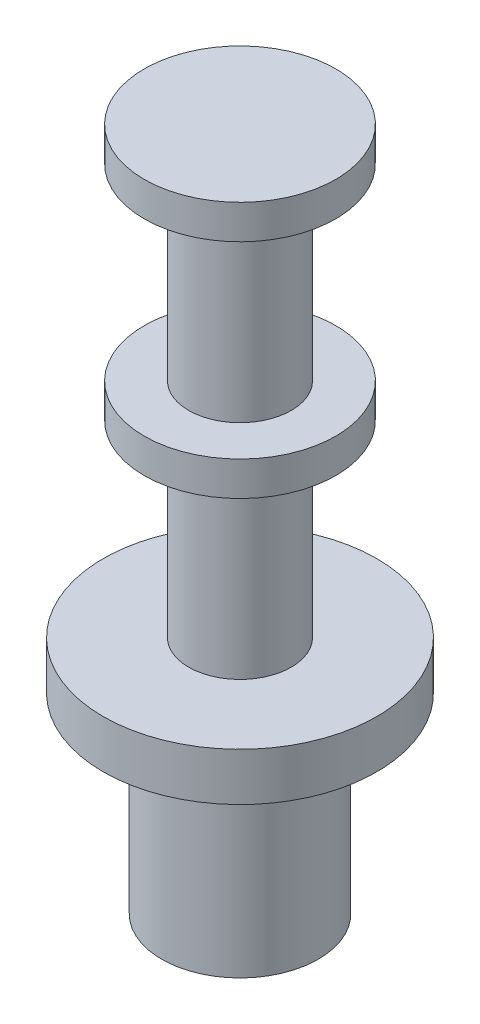
ISO-10303-21;
HEADER;
FILE_DESCRIPTION(('STEP AP214'),'2;1');
FILE_NAME('part.step','',(''),(''),'','','');
FILE_SCHEMA(('AUTOMOTIVE_DESIGN { 1 0 10303 214 1 1 1 1 }'));
ENDSEC;
DATA;
#1=APPLICATION_CONTEXT('core data for automotive mechanical design processes');
#2=APPLICATION_PROTOCOL_DEFINITION('international standard','automotive_design',2000,#1);
#3=PRODUCT_CONTEXT('',#1,'mechanical');
#4=PRODUCT('Part','Part','',(#3));
#5=PRODUCT_RELATED_PRODUCT_CATEGORY('part','',(#4));
#6=PRODUCT_DEFINITION_FORMATION('','',#4);
#7=PRODUCT_DEFINITION_CONTEXT('part definition',#1,'design');
#8=PRODUCT_DEFINITION('design','',#6,#7);
#9=PRODUCT_DEFINITION_SHAPE('','',#8);
#10=(LENGTH_UNIT() NAMED_UNIT(*) SI_UNIT(.MILLI.,.METRE.));
#11=(NAMED_UNIT(*) PLANE_ANGLE_UNIT() SI_UNIT($,.RADIAN.));
#12=(NAMED_UNIT(*) SI_UNIT($,.STERADIAN.) SOLID_ANGLE_UNIT());
#13=UNCERTAINTY_MEASURE_WITH_UNIT(LENGTH_MEASURE(1.E-05),#10,'distance_accuracy_value','');
#14=(GEOMETRIC_REPRESENTATION_CONTEXT(3) GLOBAL_UNCERTAINTY_ASSIGNED_CONTEXT((#13)) GLOBAL_UNIT_ASSIGNED_CONTEXT((#10,
#11,#12)) REPRESENTATION_CONTEXT('',''));
#15=CARTESIAN_POINT('',(0.,0.,0.));
#16=DIRECTION('',(0.,0.,1.));
#17=DIRECTION('',(1.,0.,0.));
#18=AXIS2_PLACEMENT_3D('',#15,#16,#17);
#19=CARTESIAN_POINT('',(0.,0.7,0.));
#20=DIRECTION('',(0.,-1.,0.));
#21=DIRECTION('',(0.,0.,-1.));
#22=AXIS2_PLACEMENT_3D('',#19,#20,#21);
#23=CYLINDRICAL_SURFACE('',#22,2.);
#24=CARTESIAN_POINT('',(0.,0.7,0.));
#25=DIRECTION('',(0.,1.,0.));
#26=DIRECTION('',(0.,0.,1.));
#27=AXIS2_PLACEMENT_3D('',#24,#25,#26);
#28=CIRCLE('',#27,2.);
#29=CARTESIAN_POINT('',(0.,0.7,2.));
#30=VERTEX_POINT('',#29);
#31=EDGE_CURVE('E70',#30,#30,#28,.T.);
#32=ORIENTED_EDGE('',*,*,#31,.F.);
#33=EDGE_LOOP('',(#32));
#34=FACE_BOUND('',#33,.T.);
#35=CARTESIAN_POINT('',(0.,0.,0.));
#36=DIRECTION('',(0.,1.,0.));
#37=DIRECTION('',(0.,0.,1.));
#38=AXIS2_PLACEMENT_3D('',#35,#36,#37);
#39=CIRCLE('',#38,2.);
#40=CARTESIAN_POINT('',(0.,0.,2.));
#41=VERTEX_POINT('',#40);
#42=EDGE_CURVE('E37',#41,#41,#39,.T.);
#43=ORIENTED_EDGE('',*,*,#42,.T.);
#44=EDGE_LOOP('',(#43));
#45=FACE_BOUND('',#44,.T.);
#46=ADVANCED_FACE('F34',(#34,#45),#23,.T.);
#47=CARTESIAN_POINT('',(0.,0.7,0.));
#48=DIRECTION('',(0.,1.,0.));
#49=DIRECTION('',(0.,0.,1.));
#50=AXIS2_PLACEMENT_3D('',#47,#48,#49);
#51=PLANE('',#50);
#52=CARTESIAN_POINT('',(0.,0.7,0.));
#53=DIRECTION('',(0.,1.,0.));
#54=DIRECTION('',(0.,0.,1.));
#55=AXIS2_PLACEMENT_3D('',#52,#53,#54);
#56=CIRCLE('',#55,0.75);
#57=CARTESIAN_POINT('',(0.,0.7,0.75));
#58=VERTEX_POINT('',#57);
#59=EDGE_CURVE('E46',#58,#58,#56,.T.);
#60=ORIENTED_EDGE('',*,*,#59,.F.);
#61=EDGE_LOOP('',(#60));
#62=FACE_BOUND('',#61,.T.);
#63=ORIENTED_EDGE('',*,*,#31,.T.);
#64=EDGE_LOOP('',(#63));
#65=FACE_BOUND('',#64,.T.);
#66=ADVANCED_FACE('F81',(#62,#65),#51,.T.);
#67=CARTESIAN_POINT('',(0.,0.,0.));
#68=DIRECTION('',(0.,1.,0.));
#69=DIRECTION('',(0.,0.,1.));
#70=AXIS2_PLACEMENT_3D('',#67,#68,#69);
#71=PLANE('',#70);
#72=CARTESIAN_POINT('',(0.,0.,0.));
#73=DIRECTION('',(0.,-1.,0.));
#74=DIRECTION('',(0.,0.,-1.));
#75=AXIS2_PLACEMENT_3D('',#72,#73,#74);
#76=CIRCLE('',#75,1.145);
#77=CARTESIAN_POINT('',(0.,0.,-1.145));
#78=VERTEX_POINT('',#77);
#79=EDGE_CURVE('E10',#78,#78,#76,.T.);
#80=ORIENTED_EDGE('',*,*,#79,.F.);
#81=EDGE_LOOP('',(#80));
#82=FACE_BOUND('',#81,.T.);
#83=ORIENTED_EDGE('',*,*,#42,.F.);
#84=EDGE_LOOP('',(#83));
#85=FACE_BOUND('',#84,.T.);
#86=ADVANCED_FACE('F78',(#82,#85),#71,.F.);
#87=CARTESIAN_POINT('',(0.,3.45,0.));
#88=DIRECTION('',(0.,-1.,0.));
#89=DIRECTION('',(0.,0.,-1.));
#90=AXIS2_PLACEMENT_3D('',#87,#88,#89);
#91=CYLINDRICAL_SURFACE('',#90,0.75);
#92=CARTESIAN_POINT('',(0.,3.45,0.));
#93=DIRECTION('',(0.,1.,0.));
#94=DIRECTION('',(0.,0.,1.));
#95=AXIS2_PLACEMENT_3D('',#92,#93,#94);
#96=CIRCLE('',#95,0.75);
#97=CARTESIAN_POINT('',(0.,3.45,0.75));
#98=VERTEX_POINT('',#97);
#99=EDGE_CURVE('E64',#98,#98,#96,.T.);
#100=ORIENTED_EDGE('',*,*,#99,.F.);
#101=EDGE_LOOP('',(#100));
#102=FACE_BOUND('',#101,.T.);
#103=ORIENTED_EDGE('',*,*,#59,.T.);
#104=EDGE_LOOP('',(#103));
#105=FACE_BOUND('',#104,.T.);
#106=ADVANCED_FACE('F80',(#102,#105),#91,.T.);
#107=CARTESIAN_POINT('',(0.,3.95,0.));
#108=DIRECTION('',(0.,-1.,0.));
#109=DIRECTION('',(0.,0.,-1.));
#110=AXIS2_PLACEMENT_3D('',#107,#108,#109);
#111=CYLINDRICAL_SURFACE('',#110,1.4);
#112=CARTESIAN_POINT('',(0.,3.95,0.));
#113=DIRECTION('',(0.,1.,0.));
#114=DIRECTION('',(0.,0.,1.));
#115=AXIS2_PLACEMENT_3D('',#112,#113,#114);
#116=CIRCLE('',#115,1.4);
#117=CARTESIAN_POINT('',(0.,3.95,1.4));
#118=VERTEX_POINT('',#117);
#119=EDGE_CURVE('E61',#118,#118,#116,.T.);
#120=ORIENTED_EDGE('',*,*,#119,.F.);
#121=EDGE_LOOP('',(#120));
#122=FACE_BOUND('',#121,.T.);
#123=CARTESIAN_POINT('',(0.,3.45,0.));
#124=DIRECTION('',(0.,1.,0.));
#125=DIRECTION('',(0.,0.,1.));
#126=AXIS2_PLACEMENT_3D('',#123,#124,#125);
#127=CIRCLE('',#126,1.4);
#128=CARTESIAN_POINT('',(0.,3.45,1.4));
#129=VERTEX_POINT('',#128);
#130=EDGE_CURVE('E59',#129,#129,#127,.T.);
#131=ORIENTED_EDGE('',*,*,#130,.T.);
#132=EDGE_LOOP('',(#131));
#133=FACE_BOUND('',#132,.T.);
#134=ADVANCED_FACE('F87',(#122,#133),#111,.T.);
#135=CARTESIAN_POINT('',(0.,3.95,0.));
#136=DIRECTION('',(0.,1.,0.));
#137=DIRECTION('',(0.,0.,1.));
#138=AXIS2_PLACEMENT_3D('',#135,#136,#137);
#139=PLANE('',#138);
#140=CARTESIAN_POINT('',(0.,3.95,0.));
#141=DIRECTION('',(0.,1.,0.));
#142=DIRECTION('',(0.,0.,1.));
#143=AXIS2_PLACEMENT_3D('',#140,#141,#142);
#144=CIRCLE('',#143,0.75);
#145=CARTESIAN_POINT('',(0.,3.95,0.75));
#146=VERTEX_POINT('',#145);
#147=EDGE_CURVE('E41',#146,#146,#144,.T.);
#148=ORIENTED_EDGE('',*,*,#147,.F.);
#149=EDGE_LOOP('',(#148));
#150=FACE_BOUND('',#149,.T.);
#151=ORIENTED_EDGE('',*,*,#119,.T.);
#152=EDGE_LOOP('',(#151));
#153=FACE_BOUND('',#152,.T.);
#154=ADVANCED_FACE('F116',(#150,#153),#139,.T.);
#155=CARTESIAN_POINT('',(0.,3.45,0.));
#156=DIRECTION('',(0.,1.,0.));
#157=DIRECTION('',(0.,0.,1.));
#158=AXIS2_PLACEMENT_3D('',#155,#156,#157);
#159=PLANE('',#158);
#160=ORIENTED_EDGE('',*,*,#99,.T.);
#161=EDGE_LOOP('',(#160));
#162=FACE_BOUND('',#161,.T.);
#163=ORIENTED_EDGE('',*,*,#130,.F.);
#164=EDGE_LOOP('',(#163));
#165=FACE_BOUND('',#164,.T.);
#166=ADVANCED_FACE('F124',(#162,#165),#159,.F.);
#167=CARTESIAN_POINT('',(0.,6.7,0.));
#168=DIRECTION('',(0.,-1.,0.));
#169=DIRECTION('',(0.,0.,-1.));
#170=AXIS2_PLACEMENT_3D('',#167,#168,#169);
#171=CYLINDRICAL_SURFACE('',#170,0.75);
#172=CARTESIAN_POINT('',(0.,6.7,0.));
#173=DIRECTION('',(0.,1.,0.));
#174=DIRECTION('',(0.,0.,1.));
#175=AXIS2_PLACEMENT_3D('',#172,#173,#174);
#176=CIRCLE('',#175,0.75);
#177=CARTESIAN_POINT('',(0.,6.7,0.75));
#178=VERTEX_POINT('',#177);
#179=EDGE_CURVE('E54',#178,#178,#176,.T.);
#180=ORIENTED_EDGE('',*,*,#179,.F.);
#181=EDGE_LOOP('',(#180));
#182=FACE_BOUND('',#181,.T.);
#183=ORIENTED_EDGE('',*,*,#147,.T.);
#184=EDGE_LOOP('',(#183));
#185=FACE_BOUND('',#184,.T.);
#186=ADVANCED_FACE('F129',(#182,#185),#171,.T.);
#187=CARTESIAN_POINT('',(0.,7.2,0.));
#188=DIRECTION('',(0.,-1.,0.));
#189=DIRECTION('',(0.,0.,-1.));
#190=AXIS2_PLACEMENT_3D('',#187,#188,#189);
#191=CYLINDRICAL_SURFACE('',#190,1.4);
#192=CARTESIAN_POINT('',(0.,7.2,0.));
#193=DIRECTION('',(0.,1.,0.));
#194=DIRECTION('',(0.,0.,1.));
#195=AXIS2_PLACEMENT_3D('',#192,#193,#194);
#196=CIRCLE('',#195,1.4);
#197=CARTESIAN_POINT('',(0.,7.2,1.4));
#198=VERTEX_POINT('',#197);
#199=EDGE_CURVE('E51',#198,#198,#196,.T.);
#200=ORIENTED_EDGE('',*,*,#199,.F.);
#201=EDGE_LOOP('',(#200));
#202=FACE_BOUND('',#201,.T.);
#203=CARTESIAN_POINT('',(0.,6.7,0.));
#204=DIRECTION('',(0.,1.,0.));
#205=DIRECTION('',(0.,0.,1.));
#206=AXIS2_PLACEMENT_3D('',#203,#204,#205);
#207=CIRCLE('',#206,1.4);
#208=CARTESIAN_POINT('',(0.,6.7,1.4));
#209=VERTEX_POINT('',#208);
#210=EDGE_CURVE('E55',#209,#209,#207,.T.);
#211=ORIENTED_EDGE('',*,*,#210,.T.);
#212=EDGE_LOOP('',(#211));
#213=FACE_BOUND('',#212,.T.);
#214=ADVANCED_FACE('F146',(#202,#213),#191,.T.);
#215=CARTESIAN_POINT('',(0.,7.2,0.));
#216=DIRECTION('',(0.,1.,0.));
#217=DIRECTION('',(0.,0.,1.));
#218=AXIS2_PLACEMENT_3D('',#215,#216,#217);
#219=PLANE('',#218);
#220=ORIENTED_EDGE('',*,*,#199,.T.);
#221=EDGE_LOOP('',(#220));
#222=FACE_BOUND('',#221,.T.);
#223=ADVANCED_FACE('F156',(#222),#219,.T.);
#224=CARTESIAN_POINT('',(0.,6.7,0.));
#225=DIRECTION('',(0.,1.,0.));
#226=DIRECTION('',(0.,0.,1.));
#227=AXIS2_PLACEMENT_3D('',#224,#225,#226);
#228=PLANE('',#227);
#229=ORIENTED_EDGE('',*,*,#179,.T.);
#230=EDGE_LOOP('',(#229));
#231=FACE_BOUND('',#230,.T.);
#232=ORIENTED_EDGE('',*,*,#210,.F.);
#233=EDGE_LOOP('',(#232));
#234=FACE_BOUND('',#233,.T.);
#235=ADVANCED_FACE('F166',(#231,#234),#228,.F.);
#236=CARTESIAN_POINT('',(0.,-2.8,0.));
#237=DIRECTION('',(0.,1.,0.));
#238=DIRECTION('',(0.,0.,1.));
#239=AXIS2_PLACEMENT_3D('',#236,#237,#238);
#240=CYLINDRICAL_SURFACE('',#239,1.145);
#241=CARTESIAN_POINT('',(0.,-2.8,0.));
#242=DIRECTION('',(0.,-1.,0.));
#243=DIRECTION('',(0.,0.,-1.));
#244=AXIS2_PLACEMENT_3D('',#241,#242,#243);
#245=CIRCLE('',#244,1.145);
#246=CARTESIAN_POINT('',(0.,-2.8,-1.145));
#247=VERTEX_POINT('',#246);
#248=EDGE_CURVE('E50',#247,#247,#245,.T.);
#249=ORIENTED_EDGE('',*,*,#248,.F.);
#250=EDGE_LOOP('',(#249));
#251=FACE_BOUND('',#250,.T.);
#252=ORIENTED_EDGE('',*,*,#79,.T.);
#253=EDGE_LOOP('',(#252));
#254=FACE_BOUND('',#253,.T.);
#255=ADVANCED_FACE('F175',(#251,#254),#240,.T.);
#256=CARTESIAN_POINT('',(0.,-2.8,0.));
#257=DIRECTION('',(0.,-1.,0.));
#258=DIRECTION('',(0.,0.,-1.));
#259=AXIS2_PLACEMENT_3D('',#256,#257,#258);
#260=PLANE('',#259);
#261=ORIENTED_EDGE('',*,*,#248,.T.);
#262=EDGE_LOOP('',(#261));
#263=FACE_BOUND('',#262,.T.);
#264=ADVANCED_FACE('F189',(#263),#260,.T.);
#265=CLOSED_SHELL('',(#46,#66,#86,#106,#134,#154,#166,#186,#214,#223,#235,#255,#264));
#266=MANIFOLD_SOLID_BREP('B2',#265);
#267=ADVANCED_BREP_SHAPE_REPRESENTATION('',(#18,#266),#14);
#268=SHAPE_DEFINITION_REPRESENTATION(#9,#267);
ENDSEC;
END-ISO-10303-21;
